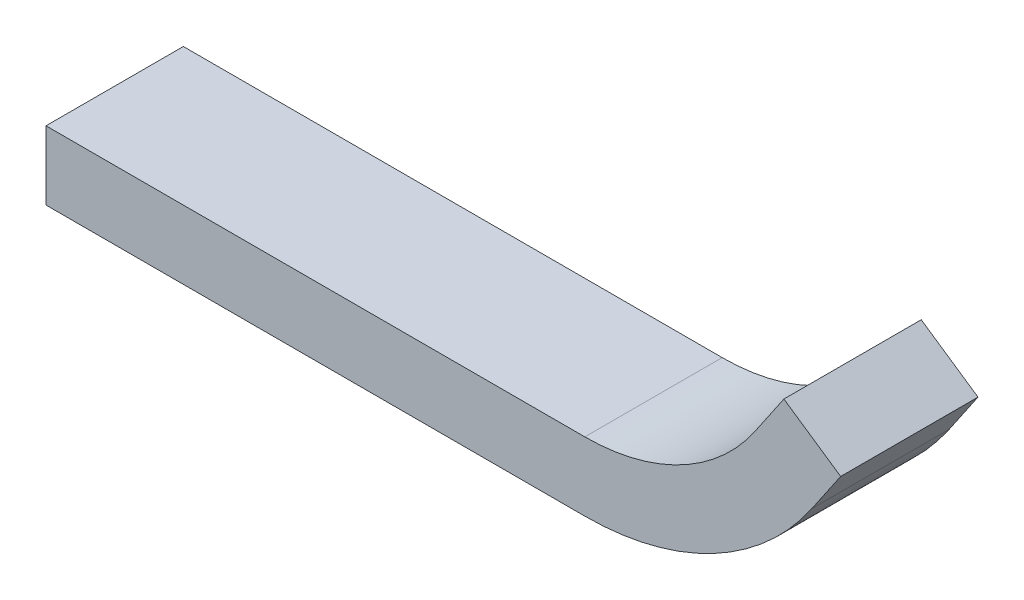
ISO-10303-21;
HEADER;
FILE_DESCRIPTION(('STEP AP214'),'2;1');
FILE_NAME('part.step','',(''),(''),'','','');
FILE_SCHEMA(('AUTOMOTIVE_DESIGN { 1 0 10303 214 1 1 1 1 }'));
ENDSEC;
DATA;
#1=APPLICATION_CONTEXT('core data for automotive mechanical design processes');
#2=APPLICATION_PROTOCOL_DEFINITION('international standard','automotive_design',2000,#1);
#3=PRODUCT_CONTEXT('',#1,'mechanical');
#4=PRODUCT('Part','Part','',(#3));
#5=PRODUCT_RELATED_PRODUCT_CATEGORY('part','',(#4));
#6=PRODUCT_DEFINITION_FORMATION('','',#4);
#7=PRODUCT_DEFINITION_CONTEXT('part definition',#1,'design');
#8=PRODUCT_DEFINITION('design','',#6,#7);
#9=PRODUCT_DEFINITION_SHAPE('','',#8);
#10=(LENGTH_UNIT() NAMED_UNIT(*) SI_UNIT(.MILLI.,.METRE.));
#11=(NAMED_UNIT(*) PLANE_ANGLE_UNIT() SI_UNIT($,.RADIAN.));
#12=(NAMED_UNIT(*) SI_UNIT($,.STERADIAN.) SOLID_ANGLE_UNIT());
#13=UNCERTAINTY_MEASURE_WITH_UNIT(LENGTH_MEASURE(1.E-05),#10,'distance_accuracy_value','');
#14=(GEOMETRIC_REPRESENTATION_CONTEXT(3) GLOBAL_UNCERTAINTY_ASSIGNED_CONTEXT((#13)) GLOBAL_UNIT_ASSIGNED_CONTEXT((#10,
#11,#12)) REPRESENTATION_CONTEXT('',''));
#15=CARTESIAN_POINT('',(0.,0.,0.));
#16=DIRECTION('',(0.,0.,1.));
#17=DIRECTION('',(1.,0.,0.));
#18=AXIS2_PLACEMENT_3D('',#15,#16,#17);
#19=CARTESIAN_POINT('',(107.454837064109,19.2695048454823,0.));
#20=DIRECTION('',(0.563000822281162,0.826456335271704,0.));
#21=DIRECTION('',(0.,0.,1.));
#22=AXIS2_PLACEMENT_3D('',#19,#20,#21);
#23=PLANE('',#22);
#24=DIRECTION('',(0.826456335271704,-0.563000822281162,0.));
#25=VECTOR('',#24,1.);
#26=CARTESIAN_POINT('',(107.454837064109,19.2695048454823,0.));
#27=LINE('',#26,#25);
#28=CARTESIAN_POINT('',(107.454837064109,19.2695048454823,0.));
#29=VERTEX_POINT('',#28);
#30=CARTESIAN_POINT('',(115.719400416826,13.6394966226707,0.));
#31=VERTEX_POINT('',#30);
#32=EDGE_CURVE('E11',#29,#31,#27,.T.);
#33=ORIENTED_EDGE('',*,*,#32,.F.);
#34=DIRECTION('',(0.,0.,1.));
#35=VECTOR('',#34,1.);
#36=CARTESIAN_POINT('',(107.454837064109,19.2695048454823,0.));
#37=LINE('',#36,#35);
#38=CARTESIAN_POINT('',(107.454837064109,19.2695048454823,20.));
#39=VERTEX_POINT('',#38);
#40=EDGE_CURVE('E153',#29,#39,#37,.T.);
#41=ORIENTED_EDGE('',*,*,#40,.T.);
#42=DIRECTION('',(0.826456335271704,-0.563000822281162,0.));
#43=VECTOR('',#42,1.);
#44=CARTESIAN_POINT('',(107.454837064109,19.2695048454823,20.));
#45=LINE('',#44,#43);
#46=CARTESIAN_POINT('',(115.719400416826,13.6394966226707,20.));
#47=VERTEX_POINT('',#46);
#48=EDGE_CURVE('E44',#39,#47,#45,.T.);
#49=ORIENTED_EDGE('',*,*,#48,.T.);
#50=DIRECTION('',(0.,0.,1.));
#51=VECTOR('',#50,1.);
#52=CARTESIAN_POINT('',(115.719400416826,13.6394966226707,0.));
#53=LINE('',#52,#51);
#54=EDGE_CURVE('E138',#31,#47,#53,.T.);
#55=ORIENTED_EDGE('',*,*,#54,.F.);
#56=EDGE_LOOP('',(#33,#41,#49,#55));
#57=FACE_BOUND('',#56,.T.);
#58=ADVANCED_FACE('F35',(#57),#23,.T.);
#59=CARTESIAN_POINT('',(0.,0.,20.));
#60=DIRECTION('',(0.,0.,-1.));
#61=DIRECTION('',(1.,0.,0.));
#62=AXIS2_PLACEMENT_3D('',#59,#60,#61);
#63=PLANE('',#62);
#64=DIRECTION('',(1.,0.,0.));
#65=VECTOR('',#64,1.);
#66=CARTESIAN_POINT('',(0.,-10.,20.));
#67=LINE('',#66,#65);
#68=CARTESIAN_POINT('',(0.,-10.,20.));
#69=VERTEX_POINT('',#68);
#70=CARTESIAN_POINT('',(78.4651356340314,-10.,20.));
#71=VERTEX_POINT('',#70);
#72=EDGE_CURVE('E129',#69,#71,#67,.T.);
#73=ORIENTED_EDGE('',*,*,#72,.T.);
#74=CARTESIAN_POINT('',(78.4651356340314,30.,20.));
#75=DIRECTION('',(0.,0.,1.));
#76=DIRECTION('',(1.,0.,0.));
#77=AXIS2_PLACEMENT_3D('',#74,#75,#76);
#78=CIRCLE('',#77,40.);
#79=CARTESIAN_POINT('',(111.5233890449,7.47996710875353,20.));
#80=VERTEX_POINT('',#79);
#81=EDGE_CURVE('E105',#80,#71,#78,.F.);
#82=ORIENTED_EDGE('',*,*,#81,.F.);
#83=DIRECTION('',(0.563000822281162,0.826456335271704,0.));
#84=VECTOR('',#83,1.);
#85=CARTESIAN_POINT('',(102.592576155274,-5.63000822281162,20.));
#86=LINE('',#85,#84);
#87=EDGE_CURVE('E140',#80,#47,#86,.T.);
#88=ORIENTED_EDGE('',*,*,#87,.T.);
#89=ORIENTED_EDGE('',*,*,#48,.F.);
#90=DIRECTION('',(0.563000822281162,0.826456335271704,0.));
#91=VECTOR('',#90,1.);
#92=CARTESIAN_POINT('',(94.3280128025574,0.,20.));
#93=LINE('',#92,#91);
#94=CARTESIAN_POINT('',(103.258825692183,13.1099753315651,20.));
#95=VERTEX_POINT('',#94);
#96=EDGE_CURVE('E154',#95,#39,#93,.T.);
#97=ORIENTED_EDGE('',*,*,#96,.F.);
#98=CARTESIAN_POINT('',(78.4651356340314,30.,20.));
#99=DIRECTION('',(0.,0.,1.));
#100=DIRECTION('',(1.,0.,0.));
#101=AXIS2_PLACEMENT_3D('',#98,#99,#100);
#102=CIRCLE('',#101,30.);
#103=CARTESIAN_POINT('',(78.4651356340314,0.,20.));
#104=VERTEX_POINT('',#103);
#105=EDGE_CURVE('E165',#95,#104,#102,.F.);
#106=ORIENTED_EDGE('',*,*,#105,.T.);
#107=DIRECTION('',(1.,0.,0.));
#108=VECTOR('',#107,1.);
#109=CARTESIAN_POINT('',(0.,0.,20.));
#110=LINE('',#109,#108);
#111=CARTESIAN_POINT('',(0.,0.,20.));
#112=VERTEX_POINT('',#111);
#113=EDGE_CURVE('E155',#112,#104,#110,.T.);
#114=ORIENTED_EDGE('',*,*,#113,.F.);
#115=DIRECTION('',(0.,-1.,0.));
#116=VECTOR('',#115,1.);
#117=CARTESIAN_POINT('',(0.,0.,20.));
#118=LINE('',#117,#116);
#119=EDGE_CURVE('E97',#112,#69,#118,.T.);
#120=ORIENTED_EDGE('',*,*,#119,.T.);
#121=EDGE_LOOP('',(#73,#82,#88,#89,#97,#106,#114,#120));
#122=FACE_BOUND('',#121,.T.);
#123=ADVANCED_FACE('F176',(#122),#63,.F.);
#124=CARTESIAN_POINT('',(0.,0.,0.));
#125=DIRECTION('',(1.,0.,0.));
#126=DIRECTION('',(0.,0.,1.));
#127=AXIS2_PLACEMENT_3D('',#124,#125,#126);
#128=PLANE('',#127);
#129=ORIENTED_EDGE('',*,*,#119,.F.);
#130=DIRECTION('',(0.,0.,1.));
#131=VECTOR('',#130,1.);
#132=CARTESIAN_POINT('',(0.,0.,0.));
#133=LINE('',#132,#131);
#134=CARTESIAN_POINT('',(0.,0.,0.));
#135=VERTEX_POINT('',#134);
#136=EDGE_CURVE('E118',#135,#112,#133,.T.);
#137=ORIENTED_EDGE('',*,*,#136,.F.);
#138=DIRECTION('',(0.,-1.,0.));
#139=VECTOR('',#138,1.);
#140=CARTESIAN_POINT('',(0.,0.,0.));
#141=LINE('',#140,#139);
#142=CARTESIAN_POINT('',(0.,-10.,0.));
#143=VERTEX_POINT('',#142);
#144=EDGE_CURVE('E113',#135,#143,#141,.T.);
#145=ORIENTED_EDGE('',*,*,#144,.T.);
#146=DIRECTION('',(0.,0.,-1.));
#147=VECTOR('',#146,1.);
#148=CARTESIAN_POINT('',(0.,-10.,0.));
#149=LINE('',#148,#147);
#150=EDGE_CURVE('E116',#143,#69,#149,.F.);
#151=ORIENTED_EDGE('',*,*,#150,.T.);
#152=EDGE_LOOP('',(#129,#137,#145,#151));
#153=FACE_BOUND('',#152,.T.);
#154=ADVANCED_FACE('F115',(#153),#128,.F.);
#155=CARTESIAN_POINT('',(78.4651356340314,30.,0.));
#156=DIRECTION('',(0.,0.,1.));
#157=DIRECTION('',(1.,0.,0.));
#158=AXIS2_PLACEMENT_3D('',#155,#156,#157);
#159=PLANE('',#158);
#160=CARTESIAN_POINT('',(78.4651356340314,30.,0.));
#161=DIRECTION('',(0.,0.,-1.));
#162=DIRECTION('',(-1.,0.,0.));
#163=AXIS2_PLACEMENT_3D('',#160,#161,#162);
#164=CIRCLE('',#163,30.);
#165=CARTESIAN_POINT('',(78.4651356340314,0.,0.));
#166=VERTEX_POINT('',#165);
#167=CARTESIAN_POINT('',(103.258825692183,13.1099753315651,0.));
#168=VERTEX_POINT('',#167);
#169=EDGE_CURVE('E159',#166,#168,#164,.F.);
#170=ORIENTED_EDGE('',*,*,#169,.T.);
#171=DIRECTION('',(0.563000822281162,0.826456335271704,0.));
#172=VECTOR('',#171,1.);
#173=CARTESIAN_POINT('',(94.3280128025574,0.,0.));
#174=LINE('',#173,#172);
#175=EDGE_CURVE('E151',#168,#29,#174,.T.);
#176=ORIENTED_EDGE('',*,*,#175,.T.);
#177=ORIENTED_EDGE('',*,*,#32,.T.);
#178=DIRECTION('',(0.563000822281162,0.826456335271704,0.));
#179=VECTOR('',#178,1.);
#180=CARTESIAN_POINT('',(102.592576155274,-5.63000822281162,0.));
#181=LINE('',#180,#179);
#182=CARTESIAN_POINT('',(111.5233890449,7.47996710875353,0.));
#183=VERTEX_POINT('',#182);
#184=EDGE_CURVE('E143',#183,#31,#181,.T.);
#185=ORIENTED_EDGE('',*,*,#184,.F.);
#186=CARTESIAN_POINT('',(78.4651356340314,30.,0.));
#187=DIRECTION('',(0.,0.,1.));
#188=DIRECTION('',(1.,0.,0.));
#189=AXIS2_PLACEMENT_3D('',#186,#187,#188);
#190=CIRCLE('',#189,40.);
#191=CARTESIAN_POINT('',(78.4651356340314,-10.,0.));
#192=VERTEX_POINT('',#191);
#193=EDGE_CURVE('E52',#192,#183,#190,.T.);
#194=ORIENTED_EDGE('',*,*,#193,.F.);
#195=DIRECTION('',(1.,0.,0.));
#196=VECTOR('',#195,1.);
#197=CARTESIAN_POINT('',(0.,-10.,0.));
#198=LINE('',#197,#196);
#199=EDGE_CURVE('E128',#143,#192,#198,.T.);
#200=ORIENTED_EDGE('',*,*,#199,.F.);
#201=ORIENTED_EDGE('',*,*,#144,.F.);
#202=DIRECTION('',(1.,0.,0.));
#203=VECTOR('',#202,1.);
#204=CARTESIAN_POINT('',(0.,0.,0.));
#205=LINE('',#204,#203);
#206=EDGE_CURVE('E148',#135,#166,#205,.T.);
#207=ORIENTED_EDGE('',*,*,#206,.T.);
#208=EDGE_LOOP('',(#170,#176,#177,#185,#194,#200,#201,#207));
#209=FACE_BOUND('',#208,.T.);
#210=ADVANCED_FACE('F37',(#209),#159,.F.);
#211=CARTESIAN_POINT('',(0.,-10.,0.));
#212=DIRECTION('',(0.,-1.,0.));
#213=DIRECTION('',(0.,0.,-1.));
#214=AXIS2_PLACEMENT_3D('',#211,#212,#213);
#215=PLANE('',#214);
#216=ORIENTED_EDGE('',*,*,#199,.T.);
#217=DIRECTION('',(0.,0.,-1.));
#218=VECTOR('',#217,1.);
#219=CARTESIAN_POINT('',(78.4651356340314,-10.,0.));
#220=LINE('',#219,#218);
#221=EDGE_CURVE('E132',#192,#71,#220,.F.);
#222=ORIENTED_EDGE('',*,*,#221,.T.);
#223=ORIENTED_EDGE('',*,*,#72,.F.);
#224=ORIENTED_EDGE('',*,*,#150,.F.);
#225=EDGE_LOOP('',(#216,#222,#223,#224));
#226=FACE_BOUND('',#225,.T.);
#227=ADVANCED_FACE('F126',(#226),#215,.T.);
#228=CARTESIAN_POINT('',(102.592576155274,-5.63000822281162,0.));
#229=DIRECTION('',(0.826456335271704,-0.563000822281162,0.));
#230=DIRECTION('',(0.563000822281162,0.826456335271704,0.));
#231=AXIS2_PLACEMENT_3D('',#228,#229,#230);
#232=PLANE('',#231);
#233=ORIENTED_EDGE('',*,*,#87,.F.);
#234=DIRECTION('',(0.,0.,1.));
#235=VECTOR('',#234,1.);
#236=CARTESIAN_POINT('',(111.5233890449,7.47996710875353,0.));
#237=LINE('',#236,#235);
#238=EDGE_CURVE('E122',#80,#183,#237,.F.);
#239=ORIENTED_EDGE('',*,*,#238,.T.);
#240=ORIENTED_EDGE('',*,*,#184,.T.);
#241=ORIENTED_EDGE('',*,*,#54,.T.);
#242=EDGE_LOOP('',(#233,#239,#240,#241));
#243=FACE_BOUND('',#242,.T.);
#244=ADVANCED_FACE('F174',(#243),#232,.T.);
#245=CARTESIAN_POINT('',(78.4651356340314,30.,0.));
#246=DIRECTION('',(0.,0.,1.));
#247=DIRECTION('',(1.,0.,0.));
#248=AXIS2_PLACEMENT_3D('',#245,#246,#247);
#249=CYLINDRICAL_SURFACE('',#248,40.);
#250=ORIENTED_EDGE('',*,*,#193,.T.);
#251=ORIENTED_EDGE('',*,*,#238,.F.);
#252=ORIENTED_EDGE('',*,*,#81,.T.);
#253=ORIENTED_EDGE('',*,*,#221,.F.);
#254=EDGE_LOOP('',(#250,#251,#252,#253));
#255=FACE_BOUND('',#254,.T.);
#256=ADVANCED_FACE('F177',(#255),#249,.T.);
#257=CARTESIAN_POINT('',(0.,0.,0.));
#258=DIRECTION('',(0.,-1.,0.));
#259=DIRECTION('',(0.,0.,-1.));
#260=AXIS2_PLACEMENT_3D('',#257,#258,#259);
#261=PLANE('',#260);
#262=ORIENTED_EDGE('',*,*,#206,.F.);
#263=ORIENTED_EDGE('',*,*,#136,.T.);
#264=ORIENTED_EDGE('',*,*,#113,.T.);
#265=DIRECTION('',(0.,0.,1.));
#266=VECTOR('',#265,1.);
#267=CARTESIAN_POINT('',(78.4651356340314,0.,0.));
#268=LINE('',#267,#266);
#269=EDGE_CURVE('E150',#166,#104,#268,.T.);
#270=ORIENTED_EDGE('',*,*,#269,.F.);
#271=EDGE_LOOP('',(#262,#263,#264,#270));
#272=FACE_BOUND('',#271,.T.);
#273=ADVANCED_FACE('F179',(#272),#261,.F.);
#274=CARTESIAN_POINT('',(94.3280128025574,0.,0.));
#275=DIRECTION('',(0.826456335271704,-0.563000822281162,0.));
#276=DIRECTION('',(0.563000822281162,0.826456335271704,0.));
#277=AXIS2_PLACEMENT_3D('',#274,#275,#276);
#278=PLANE('',#277);
#279=ORIENTED_EDGE('',*,*,#96,.T.);
#280=ORIENTED_EDGE('',*,*,#40,.F.);
#281=ORIENTED_EDGE('',*,*,#175,.F.);
#282=DIRECTION('',(0.,0.,1.));
#283=VECTOR('',#282,1.);
#284=CARTESIAN_POINT('',(103.258825692183,13.1099753315652,0.));
#285=LINE('',#284,#283);
#286=EDGE_CURVE('E86',#95,#168,#285,.F.);
#287=ORIENTED_EDGE('',*,*,#286,.F.);
#288=EDGE_LOOP('',(#279,#280,#281,#287));
#289=FACE_BOUND('',#288,.T.);
#290=ADVANCED_FACE('F185',(#289),#278,.F.);
#291=CARTESIAN_POINT('',(78.4651356340314,30.,0.));
#292=DIRECTION('',(0.,0.,1.));
#293=DIRECTION('',(1.,0.,0.));
#294=AXIS2_PLACEMENT_3D('',#291,#292,#293);
#295=CYLINDRICAL_SURFACE('',#294,30.);
#296=ORIENTED_EDGE('',*,*,#169,.F.);
#297=ORIENTED_EDGE('',*,*,#269,.T.);
#298=ORIENTED_EDGE('',*,*,#105,.F.);
#299=ORIENTED_EDGE('',*,*,#286,.T.);
#300=EDGE_LOOP('',(#296,#297,#298,#299));
#301=FACE_BOUND('',#300,.T.);
#302=ADVANCED_FACE('F198',(#301),#295,.F.);
#303=CLOSED_SHELL('',(#58,#123,#154,#210,#227,#244,#256,#273,#290,#302));
#304=MANIFOLD_SOLID_BREP('B2',#303);
#305=ADVANCED_BREP_SHAPE_REPRESENTATION('',(#18,#304),#14);
#306=SHAPE_DEFINITION_REPRESENTATION(#9,#305);
ENDSEC;
END-ISO-10303-21;
